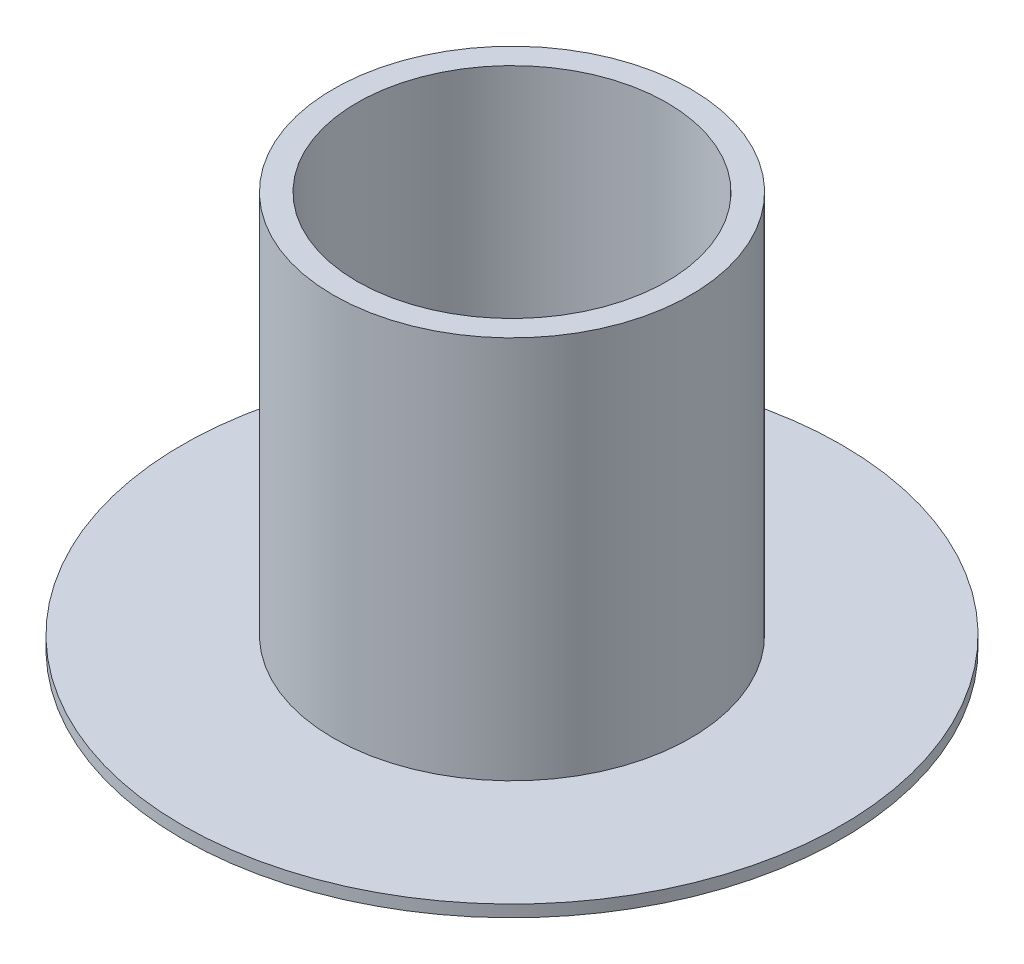
ISO-10303-21;
HEADER;
FILE_DESCRIPTION(('STEP AP214'),'2;1');
FILE_NAME('part.step','',(''),(''),'','','');
FILE_SCHEMA(('AUTOMOTIVE_DESIGN { 1 0 10303 214 1 1 1 1 }'));
ENDSEC;
DATA;
#1=APPLICATION_CONTEXT('core data for automotive mechanical design processes');
#2=APPLICATION_PROTOCOL_DEFINITION('international standard','automotive_design',2000,#1);
#3=PRODUCT_CONTEXT('',#1,'mechanical');
#4=PRODUCT('Part','Part','',(#3));
#5=PRODUCT_RELATED_PRODUCT_CATEGORY('part','',(#4));
#6=PRODUCT_DEFINITION_FORMATION('','',#4);
#7=PRODUCT_DEFINITION_CONTEXT('part definition',#1,'design');
#8=PRODUCT_DEFINITION('design','',#6,#7);
#9=PRODUCT_DEFINITION_SHAPE('','',#8);
#10=(LENGTH_UNIT() NAMED_UNIT(*) SI_UNIT(.MILLI.,.METRE.));
#11=(NAMED_UNIT(*) PLANE_ANGLE_UNIT() SI_UNIT($,.RADIAN.));
#12=(NAMED_UNIT(*) SI_UNIT($,.STERADIAN.) SOLID_ANGLE_UNIT());
#13=UNCERTAINTY_MEASURE_WITH_UNIT(LENGTH_MEASURE(1.E-05),#10,'distance_accuracy_value','');
#14=(GEOMETRIC_REPRESENTATION_CONTEXT(3) GLOBAL_UNCERTAINTY_ASSIGNED_CONTEXT((#13)) GLOBAL_UNIT_ASSIGNED_CONTEXT((#10,
#11,#12)) REPRESENTATION_CONTEXT('',''));
#15=CARTESIAN_POINT('',(0.,0.,0.));
#16=DIRECTION('',(0.,0.,1.));
#17=DIRECTION('',(1.,0.,0.));
#18=AXIS2_PLACEMENT_3D('',#15,#16,#17);
#19=CARTESIAN_POINT('',(-49.7706423901913,52.5115629984051,0.));
#20=DIRECTION('',(0.,1.,0.));
#21=DIRECTION('',(0.,0.,1.));
#22=AXIS2_PLACEMENT_3D('',#19,#20,#21);
#23=CYLINDRICAL_SURFACE('',#22,11.75);
#24=CARTESIAN_POINT('',(-49.7706423901913,41.1909888357257,0.));
#25=DIRECTION('',(0.,1.,0.));
#26=DIRECTION('',(0.,0.,1.));
#27=AXIS2_PLACEMENT_3D('',#24,#25,#26);
#28=CIRCLE('',#27,11.75);
#29=CARTESIAN_POINT('',(-49.7706423901913,41.1909888357257,11.75));
#30=VERTEX_POINT('',#29);
#31=EDGE_CURVE('E53',#30,#30,#28,.T.);
#32=ORIENTED_EDGE('',*,*,#31,.T.);
#33=EDGE_LOOP('',(#32));
#34=FACE_BOUND('',#33,.T.);
#35=CARTESIAN_POINT('',(-49.7706423901913,11.1909888357257,0.));
#36=DIRECTION('',(0.,1.,0.));
#37=DIRECTION('',(0.,0.,1.));
#38=AXIS2_PLACEMENT_3D('',#35,#36,#37);
#39=CIRCLE('',#38,11.75);
#40=CARTESIAN_POINT('',(-49.7706423901913,11.1909888357257,11.75));
#41=VERTEX_POINT('',#40);
#42=EDGE_CURVE('E10',#41,#41,#39,.T.);
#43=ORIENTED_EDGE('',*,*,#42,.F.);
#44=EDGE_LOOP('',(#43));
#45=FACE_BOUND('',#44,.T.);
#46=ADVANCED_FACE('F31',(#34,#45),#23,.F.);
#47=CARTESIAN_POINT('',(-61.5206423901913,11.1909888357257,0.));
#48=DIRECTION('',(0.,-1.,0.));
#49=DIRECTION('',(0.,0.,-1.));
#50=AXIS2_PLACEMENT_3D('',#47,#48,#49);
#51=PLANE('',#50);
#52=ORIENTED_EDGE('',*,*,#42,.T.);
#53=EDGE_LOOP('',(#52));
#54=FACE_BOUND('',#53,.T.);
#55=CARTESIAN_POINT('',(-49.7706423901913,11.1909888357257,0.));
#56=DIRECTION('',(0.,1.,0.));
#57=DIRECTION('',(0.,0.,1.));
#58=AXIS2_PLACEMENT_3D('',#55,#56,#57);
#59=CIRCLE('',#58,25.);
#60=CARTESIAN_POINT('',(-49.7706423901913,11.1909888357257,25.));
#61=VERTEX_POINT('',#60);
#62=EDGE_CURVE('E37',#61,#61,#59,.T.);
#63=ORIENTED_EDGE('',*,*,#62,.F.);
#64=EDGE_LOOP('',(#63));
#65=FACE_BOUND('',#64,.T.);
#66=ADVANCED_FACE('F71',(#54,#65),#51,.T.);
#67=CARTESIAN_POINT('',(-49.7706423901913,52.5115629984051,0.));
#68=DIRECTION('',(0.,1.,0.));
#69=DIRECTION('',(0.,0.,1.));
#70=AXIS2_PLACEMENT_3D('',#67,#68,#69);
#71=CYLINDRICAL_SURFACE('',#70,25.);
#72=ORIENTED_EDGE('',*,*,#62,.T.);
#73=EDGE_LOOP('',(#72));
#74=FACE_BOUND('',#73,.T.);
#75=CARTESIAN_POINT('',(-49.7706423901913,12.0909888357257,0.));
#76=DIRECTION('',(0.,1.,0.));
#77=DIRECTION('',(0.,0.,1.));
#78=AXIS2_PLACEMENT_3D('',#75,#76,#77);
#79=CIRCLE('',#78,25.);
#80=CARTESIAN_POINT('',(-49.7706423901913,12.0909888357257,25.));
#81=VERTEX_POINT('',#80);
#82=EDGE_CURVE('E41',#81,#81,#79,.T.);
#83=ORIENTED_EDGE('',*,*,#82,.F.);
#84=EDGE_LOOP('',(#83));
#85=FACE_BOUND('',#84,.T.);
#86=ADVANCED_FACE('F75',(#74,#85),#71,.T.);
#87=CARTESIAN_POINT('',(-74.7706423901913,12.0909888357257,0.));
#88=DIRECTION('',(0.,1.,0.));
#89=DIRECTION('',(0.,0.,1.));
#90=AXIS2_PLACEMENT_3D('',#87,#88,#89);
#91=PLANE('',#90);
#92=ORIENTED_EDGE('',*,*,#82,.T.);
#93=EDGE_LOOP('',(#92));
#94=FACE_BOUND('',#93,.T.);
#95=CARTESIAN_POINT('',(-49.7706423901913,12.0909888357257,0.));
#96=DIRECTION('',(0.,1.,0.));
#97=DIRECTION('',(0.,0.,1.));
#98=AXIS2_PLACEMENT_3D('',#95,#96,#97);
#99=CIRCLE('',#98,13.55);
#100=CARTESIAN_POINT('',(-49.7706423901913,12.0909888357257,13.55));
#101=VERTEX_POINT('',#100);
#102=EDGE_CURVE('E45',#101,#101,#99,.T.);
#103=ORIENTED_EDGE('',*,*,#102,.F.);
#104=EDGE_LOOP('',(#103));
#105=FACE_BOUND('',#104,.T.);
#106=ADVANCED_FACE('F67',(#94,#105),#91,.T.);
#107=CARTESIAN_POINT('',(-49.7706423901913,52.5115629984051,0.));
#108=DIRECTION('',(0.,1.,0.));
#109=DIRECTION('',(0.,0.,1.));
#110=AXIS2_PLACEMENT_3D('',#107,#108,#109);
#111=CYLINDRICAL_SURFACE('',#110,13.55);
#112=ORIENTED_EDGE('',*,*,#102,.T.);
#113=EDGE_LOOP('',(#112));
#114=FACE_BOUND('',#113,.T.);
#115=CARTESIAN_POINT('',(-49.7706423901913,41.1909888357257,0.));
#116=DIRECTION('',(0.,1.,0.));
#117=DIRECTION('',(0.,0.,1.));
#118=AXIS2_PLACEMENT_3D('',#115,#116,#117);
#119=CIRCLE('',#118,13.55);
#120=CARTESIAN_POINT('',(-49.7706423901913,41.1909888357257,13.55));
#121=VERTEX_POINT('',#120);
#122=EDGE_CURVE('E50',#121,#121,#119,.T.);
#123=ORIENTED_EDGE('',*,*,#122,.F.);
#124=EDGE_LOOP('',(#123));
#125=FACE_BOUND('',#124,.T.);
#126=ADVANCED_FACE('F61',(#114,#125),#111,.T.);
#127=CARTESIAN_POINT('',(-63.3206423901913,41.1909888357257,0.));
#128=DIRECTION('',(0.,1.,0.));
#129=DIRECTION('',(0.,0.,1.));
#130=AXIS2_PLACEMENT_3D('',#127,#128,#129);
#131=PLANE('',#130);
#132=ORIENTED_EDGE('',*,*,#122,.T.);
#133=EDGE_LOOP('',(#132));
#134=FACE_BOUND('',#133,.T.);
#135=ORIENTED_EDGE('',*,*,#31,.F.);
#136=EDGE_LOOP('',(#135));
#137=FACE_BOUND('',#136,.T.);
#138=ADVANCED_FACE('F59',(#134,#137),#131,.T.);
#139=CLOSED_SHELL('',(#46,#66,#86,#106,#126,#138));
#140=MANIFOLD_SOLID_BREP('B2',#139);
#141=ADVANCED_BREP_SHAPE_REPRESENTATION('',(#18,#140),#14);
#142=SHAPE_DEFINITION_REPRESENTATION(#9,#141);
ENDSEC;
END-ISO-10303-21;
